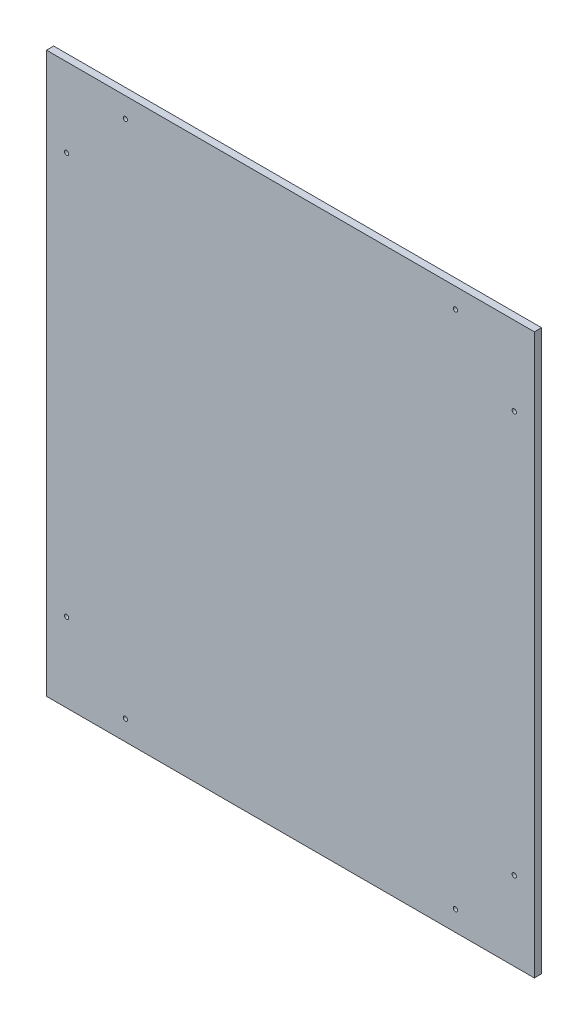
ISO-10303-21;
HEADER;
FILE_DESCRIPTION(('STEP AP214'),'2;1');
FILE_NAME('part.step','',(''),(''),'','','');
FILE_SCHEMA(('AUTOMOTIVE_DESIGN { 1 0 10303 214 1 1 1 1 }'));
ENDSEC;
DATA;
#1=APPLICATION_CONTEXT('core data for automotive mechanical design processes');
#2=APPLICATION_PROTOCOL_DEFINITION('international standard','automotive_design',2000,#1);
#3=PRODUCT_CONTEXT('',#1,'mechanical');
#4=PRODUCT('Part','Part','',(#3));
#5=PRODUCT_RELATED_PRODUCT_CATEGORY('part','',(#4));
#6=PRODUCT_DEFINITION_FORMATION('','',#4);
#7=PRODUCT_DEFINITION_CONTEXT('part definition',#1,'design');
#8=PRODUCT_DEFINITION('design','',#6,#7);
#9=PRODUCT_DEFINITION_SHAPE('','',#8);
#10=(LENGTH_UNIT() NAMED_UNIT(*) SI_UNIT(.MILLI.,.METRE.));
#11=(NAMED_UNIT(*) PLANE_ANGLE_UNIT() SI_UNIT($,.RADIAN.));
#12=(NAMED_UNIT(*) SI_UNIT($,.STERADIAN.) SOLID_ANGLE_UNIT());
#13=UNCERTAINTY_MEASURE_WITH_UNIT(LENGTH_MEASURE(1.E-05),#10,'distance_accuracy_value','');
#14=(GEOMETRIC_REPRESENTATION_CONTEXT(3) GLOBAL_UNCERTAINTY_ASSIGNED_CONTEXT((#13)) GLOBAL_UNIT_ASSIGNED_CONTEXT((#10,
#11,#12)) REPRESENTATION_CONTEXT('',''));
#15=CARTESIAN_POINT('',(0.,0.,0.));
#16=DIRECTION('',(0.,0.,1.));
#17=DIRECTION('',(1.,0.,0.));
#18=AXIS2_PLACEMENT_3D('',#15,#16,#17);
#19=CARTESIAN_POINT('',(0.,0.,5.));
#20=DIRECTION('',(0.,0.,1.));
#21=DIRECTION('',(1.,0.,0.));
#22=AXIS2_PLACEMENT_3D('',#19,#20,#21);
#23=PLANE('',#22);
#24=CARTESIAN_POINT('',(223.94719541036,35.5360255420485,5.));
#25=DIRECTION('',(0.,0.,1.));
#26=DIRECTION('',(1.,0.,0.));
#27=AXIS2_PLACEMENT_3D('',#24,#25,#26);
#28=CIRCLE('',#27,1.5);
#29=CARTESIAN_POINT('',(225.44719541036,35.5360255420485,5.));
#30=VERTEX_POINT('',#29);
#31=EDGE_CURVE('E145',#30,#30,#28,.T.);
#32=ORIENTED_EDGE('',*,*,#31,.F.);
#33=EDGE_LOOP('',(#32));
#34=FACE_BOUND('',#33,.T.);
#35=CARTESIAN_POINT('',(-6.05280458963955,-326.463974457952,5.));
#36=DIRECTION('',(0.,0.,1.));
#37=DIRECTION('',(1.,0.,0.));
#38=AXIS2_PLACEMENT_3D('',#35,#36,#37);
#39=CIRCLE('',#38,1.5);
#40=CARTESIAN_POINT('',(-4.55280458963955,-326.463974457952,5.));
#41=VERTEX_POINT('',#40);
#42=EDGE_CURVE('E133',#41,#41,#39,.T.);
#43=ORIENTED_EDGE('',*,*,#42,.F.);
#44=EDGE_LOOP('',(#43));
#45=FACE_BOUND('',#44,.T.);
#46=CARTESIAN_POINT('',(264.94719541036,-5.4639744579515,5.));
#47=DIRECTION('',(0.,0.,1.));
#48=DIRECTION('',(1.,0.,0.));
#49=AXIS2_PLACEMENT_3D('',#46,#47,#48);
#50=CIRCLE('',#49,1.50000000000002);
#51=CARTESIAN_POINT('',(266.44719541036,-5.4639744579515,5.));
#52=VERTEX_POINT('',#51);
#53=EDGE_CURVE('E121',#52,#52,#50,.T.);
#54=ORIENTED_EDGE('',*,*,#53,.F.);
#55=EDGE_LOOP('',(#54));
#56=FACE_BOUND('',#55,.T.);
#57=CARTESIAN_POINT('',(-47.0528045896396,-285.463974457952,5.));
#58=DIRECTION('',(0.,0.,1.));
#59=DIRECTION('',(1.,0.,0.));
#60=AXIS2_PLACEMENT_3D('',#57,#58,#59);
#61=CIRCLE('',#60,1.5);
#62=CARTESIAN_POINT('',(-45.5528045896396,-285.463974457952,5.));
#63=VERTEX_POINT('',#62);
#64=EDGE_CURVE('E100',#63,#63,#61,.T.);
#65=ORIENTED_EDGE('',*,*,#64,.F.);
#66=EDGE_LOOP('',(#65));
#67=FACE_BOUND('',#66,.T.);
#68=DIRECTION('',(0.,-1.,0.));
#69=VECTOR('',#68,1.);
#70=CARTESIAN_POINT('',(-61.0528045896396,49.5360255420485,5.));
#71=LINE('',#70,#69);
#72=CARTESIAN_POINT('',(-61.0528045896396,49.5360255420485,5.));
#73=VERTEX_POINT('',#72);
#74=CARTESIAN_POINT('',(-61.0528045896396,-340.463974457952,5.));
#75=VERTEX_POINT('',#74);
#76=EDGE_CURVE('E85',#73,#75,#71,.T.);
#77=ORIENTED_EDGE('',*,*,#76,.T.);
#78=DIRECTION('',(1.,0.,0.));
#79=VECTOR('',#78,1.);
#80=CARTESIAN_POINT('',(-61.0528045896396,-340.463974457952,5.));
#81=LINE('',#80,#79);
#82=CARTESIAN_POINT('',(278.94719541036,-340.463974457952,5.));
#83=VERTEX_POINT('',#82);
#84=EDGE_CURVE('E80',#75,#83,#81,.T.);
#85=ORIENTED_EDGE('',*,*,#84,.T.);
#86=DIRECTION('',(0.,1.,0.));
#87=VECTOR('',#86,1.);
#88=CARTESIAN_POINT('',(278.94719541036,49.5360255420485,5.));
#89=LINE('',#88,#87);
#90=CARTESIAN_POINT('',(278.94719541036,49.5360255420485,5.));
#91=VERTEX_POINT('',#90);
#92=EDGE_CURVE('E83',#83,#91,#89,.T.);
#93=ORIENTED_EDGE('',*,*,#92,.T.);
#94=DIRECTION('',(-1.,0.,0.));
#95=VECTOR('',#94,1.);
#96=CARTESIAN_POINT('',(-61.0528045896396,49.5360255420485,5.));
#97=LINE('',#96,#95);
#98=EDGE_CURVE('E50',#91,#73,#97,.T.);
#99=ORIENTED_EDGE('',*,*,#98,.T.);
#100=EDGE_LOOP('',(#77,#85,#93,#99));
#101=FACE_BOUND('',#100,.T.);
#102=CARTESIAN_POINT('',(264.94719541036,-285.463974457952,5.));
#103=DIRECTION('',(0.,0.,1.));
#104=DIRECTION('',(1.,0.,0.));
#105=AXIS2_PLACEMENT_3D('',#102,#103,#104);
#106=CIRCLE('',#105,1.50000000000002);
#107=CARTESIAN_POINT('',(266.44719541036,-285.463974457952,5.));
#108=VERTEX_POINT('',#107);
#109=EDGE_CURVE('E115',#108,#108,#106,.T.);
#110=ORIENTED_EDGE('',*,*,#109,.F.);
#111=EDGE_LOOP('',(#110));
#112=FACE_BOUND('',#111,.T.);
#113=CARTESIAN_POINT('',(-47.0528045896396,-5.4639744579515,5.));
#114=DIRECTION('',(0.,0.,1.));
#115=DIRECTION('',(1.,0.,0.));
#116=AXIS2_PLACEMENT_3D('',#113,#114,#115);
#117=CIRCLE('',#116,1.5);
#118=CARTESIAN_POINT('',(-45.5528045896396,-5.4639744579515,5.));
#119=VERTEX_POINT('',#118);
#120=EDGE_CURVE('E127',#119,#119,#117,.T.);
#121=ORIENTED_EDGE('',*,*,#120,.F.);
#122=EDGE_LOOP('',(#121));
#123=FACE_BOUND('',#122,.T.);
#124=CARTESIAN_POINT('',(223.94719541036,-326.463974457952,5.));
#125=DIRECTION('',(0.,0.,1.));
#126=DIRECTION('',(1.,0.,0.));
#127=AXIS2_PLACEMENT_3D('',#124,#125,#126);
#128=CIRCLE('',#127,1.5);
#129=CARTESIAN_POINT('',(225.44719541036,-326.463974457952,5.));
#130=VERTEX_POINT('',#129);
#131=EDGE_CURVE('E139',#130,#130,#128,.T.);
#132=ORIENTED_EDGE('',*,*,#131,.F.);
#133=EDGE_LOOP('',(#132));
#134=FACE_BOUND('',#133,.T.);
#135=CARTESIAN_POINT('',(-6.0528045896396,35.5360255420485,5.));
#136=DIRECTION('',(0.,0.,1.));
#137=DIRECTION('',(1.,0.,0.));
#138=AXIS2_PLACEMENT_3D('',#135,#136,#137);
#139=CIRCLE('',#138,1.5);
#140=CARTESIAN_POINT('',(-4.5528045896396,35.5360255420485,5.));
#141=VERTEX_POINT('',#140);
#142=EDGE_CURVE('E151',#141,#141,#139,.T.);
#143=ORIENTED_EDGE('',*,*,#142,.F.);
#144=EDGE_LOOP('',(#143));
#145=FACE_BOUND('',#144,.T.);
#146=ADVANCED_FACE('F33',(#34,#45,#56,#67,#101,#112,#123,#134,#145),#23,.T.);
#147=CARTESIAN_POINT('',(0.,0.,0.));
#148=DIRECTION('',(0.,0.,1.));
#149=DIRECTION('',(1.,0.,0.));
#150=AXIS2_PLACEMENT_3D('',#147,#148,#149);
#151=PLANE('',#150);
#152=DIRECTION('',(0.,-1.,0.));
#153=VECTOR('',#152,1.);
#154=CARTESIAN_POINT('',(-61.0528045896396,49.5360255420485,0.));
#155=LINE('',#154,#153);
#156=CARTESIAN_POINT('',(-61.0528045896396,49.5360255420485,0.));
#157=VERTEX_POINT('',#156);
#158=CARTESIAN_POINT('',(-61.0528045896396,-340.463974457952,0.));
#159=VERTEX_POINT('',#158);
#160=EDGE_CURVE('E97',#157,#159,#155,.T.);
#161=ORIENTED_EDGE('',*,*,#160,.F.);
#162=DIRECTION('',(-1.,0.,0.));
#163=VECTOR('',#162,1.);
#164=CARTESIAN_POINT('',(-61.0528045896396,49.5360255420485,0.));
#165=LINE('',#164,#163);
#166=CARTESIAN_POINT('',(278.94719541036,49.5360255420485,0.));
#167=VERTEX_POINT('',#166);
#168=EDGE_CURVE('E73',#167,#157,#165,.T.);
#169=ORIENTED_EDGE('',*,*,#168,.F.);
#170=DIRECTION('',(0.,1.,0.));
#171=VECTOR('',#170,1.);
#172=CARTESIAN_POINT('',(278.94719541036,49.5360255420485,0.));
#173=LINE('',#172,#171);
#174=CARTESIAN_POINT('',(278.94719541036,-340.463974457952,0.));
#175=VERTEX_POINT('',#174);
#176=EDGE_CURVE('E67',#175,#167,#173,.T.);
#177=ORIENTED_EDGE('',*,*,#176,.F.);
#178=DIRECTION('',(1.,0.,0.));
#179=VECTOR('',#178,1.);
#180=CARTESIAN_POINT('',(-61.0528045896396,-340.463974457952,0.));
#181=LINE('',#180,#179);
#182=EDGE_CURVE('E89',#159,#175,#181,.T.);
#183=ORIENTED_EDGE('',*,*,#182,.F.);
#184=EDGE_LOOP('',(#161,#169,#177,#183));
#185=FACE_BOUND('',#184,.T.);
#186=CARTESIAN_POINT('',(-47.0528045896396,-285.463974457952,0.));
#187=DIRECTION('',(0.,0.,1.));
#188=DIRECTION('',(1.,0.,0.));
#189=AXIS2_PLACEMENT_3D('',#186,#187,#188);
#190=CIRCLE('',#189,1.5);
#191=CARTESIAN_POINT('',(-45.5528045896396,-285.463974457952,0.));
#192=VERTEX_POINT('',#191);
#193=EDGE_CURVE('E112',#192,#192,#190,.T.);
#194=ORIENTED_EDGE('',*,*,#193,.T.);
#195=EDGE_LOOP('',(#194));
#196=FACE_BOUND('',#195,.T.);
#197=CARTESIAN_POINT('',(264.94719541036,-285.463974457952,0.));
#198=DIRECTION('',(0.,0.,1.));
#199=DIRECTION('',(1.,0.,0.));
#200=AXIS2_PLACEMENT_3D('',#197,#198,#199);
#201=CIRCLE('',#200,1.50000000000002);
#202=CARTESIAN_POINT('',(266.44719541036,-285.463974457952,0.));
#203=VERTEX_POINT('',#202);
#204=EDGE_CURVE('E118',#203,#203,#201,.T.);
#205=ORIENTED_EDGE('',*,*,#204,.T.);
#206=EDGE_LOOP('',(#205));
#207=FACE_BOUND('',#206,.T.);
#208=CARTESIAN_POINT('',(264.94719541036,-5.4639744579515,0.));
#209=DIRECTION('',(0.,0.,1.));
#210=DIRECTION('',(1.,0.,0.));
#211=AXIS2_PLACEMENT_3D('',#208,#209,#210);
#212=CIRCLE('',#211,1.50000000000002);
#213=CARTESIAN_POINT('',(266.44719541036,-5.4639744579515,0.));
#214=VERTEX_POINT('',#213);
#215=EDGE_CURVE('E124',#214,#214,#212,.T.);
#216=ORIENTED_EDGE('',*,*,#215,.T.);
#217=EDGE_LOOP('',(#216));
#218=FACE_BOUND('',#217,.T.);
#219=CARTESIAN_POINT('',(-47.0528045896396,-5.4639744579515,0.));
#220=DIRECTION('',(0.,0.,1.));
#221=DIRECTION('',(1.,0.,0.));
#222=AXIS2_PLACEMENT_3D('',#219,#220,#221);
#223=CIRCLE('',#222,1.5);
#224=CARTESIAN_POINT('',(-45.5528045896396,-5.4639744579515,0.));
#225=VERTEX_POINT('',#224);
#226=EDGE_CURVE('E130',#225,#225,#223,.T.);
#227=ORIENTED_EDGE('',*,*,#226,.T.);
#228=EDGE_LOOP('',(#227));
#229=FACE_BOUND('',#228,.T.);
#230=CARTESIAN_POINT('',(-6.05280458963955,-326.463974457952,0.));
#231=DIRECTION('',(0.,0.,1.));
#232=DIRECTION('',(1.,0.,0.));
#233=AXIS2_PLACEMENT_3D('',#230,#231,#232);
#234=CIRCLE('',#233,1.5);
#235=CARTESIAN_POINT('',(-4.55280458963955,-326.463974457952,0.));
#236=VERTEX_POINT('',#235);
#237=EDGE_CURVE('E136',#236,#236,#234,.T.);
#238=ORIENTED_EDGE('',*,*,#237,.T.);
#239=EDGE_LOOP('',(#238));
#240=FACE_BOUND('',#239,.T.);
#241=CARTESIAN_POINT('',(223.94719541036,-326.463974457952,0.));
#242=DIRECTION('',(0.,0.,1.));
#243=DIRECTION('',(1.,0.,0.));
#244=AXIS2_PLACEMENT_3D('',#241,#242,#243);
#245=CIRCLE('',#244,1.5);
#246=CARTESIAN_POINT('',(225.44719541036,-326.463974457952,0.));
#247=VERTEX_POINT('',#246);
#248=EDGE_CURVE('E142',#247,#247,#245,.T.);
#249=ORIENTED_EDGE('',*,*,#248,.T.);
#250=EDGE_LOOP('',(#249));
#251=FACE_BOUND('',#250,.T.);
#252=CARTESIAN_POINT('',(223.94719541036,35.5360255420485,0.));
#253=DIRECTION('',(0.,0.,1.));
#254=DIRECTION('',(1.,0.,0.));
#255=AXIS2_PLACEMENT_3D('',#252,#253,#254);
#256=CIRCLE('',#255,1.5);
#257=CARTESIAN_POINT('',(225.44719541036,35.5360255420485,0.));
#258=VERTEX_POINT('',#257);
#259=EDGE_CURVE('E148',#258,#258,#256,.T.);
#260=ORIENTED_EDGE('',*,*,#259,.T.);
#261=EDGE_LOOP('',(#260));
#262=FACE_BOUND('',#261,.T.);
#263=CARTESIAN_POINT('',(-6.0528045896396,35.5360255420485,0.));
#264=DIRECTION('',(0.,0.,1.));
#265=DIRECTION('',(1.,0.,0.));
#266=AXIS2_PLACEMENT_3D('',#263,#264,#265);
#267=CIRCLE('',#266,1.5);
#268=CARTESIAN_POINT('',(-4.5528045896396,35.5360255420485,0.));
#269=VERTEX_POINT('',#268);
#270=EDGE_CURVE('E154',#269,#269,#267,.T.);
#271=ORIENTED_EDGE('',*,*,#270,.T.);
#272=EDGE_LOOP('',(#271));
#273=FACE_BOUND('',#272,.T.);
#274=ADVANCED_FACE('F108',(#185,#196,#207,#218,#229,#240,#251,#262,#273),#151,.F.);
#275=CARTESIAN_POINT('',(-61.0528045896396,49.5360255420485,5.));
#276=DIRECTION('',(1.,0.,0.));
#277=DIRECTION('',(0.,1.,0.));
#278=AXIS2_PLACEMENT_3D('',#275,#276,#277);
#279=PLANE('',#278);
#280=ORIENTED_EDGE('',*,*,#160,.T.);
#281=DIRECTION('',(0.,0.,-1.));
#282=VECTOR('',#281,1.);
#283=CARTESIAN_POINT('',(-61.0528045896396,-340.463974457952,5.));
#284=LINE('',#283,#282);
#285=EDGE_CURVE('E11',#75,#159,#284,.T.);
#286=ORIENTED_EDGE('',*,*,#285,.F.);
#287=ORIENTED_EDGE('',*,*,#76,.F.);
#288=DIRECTION('',(0.,0.,-1.));
#289=VECTOR('',#288,1.);
#290=CARTESIAN_POINT('',(-61.0528045896396,49.5360255420485,5.));
#291=LINE('',#290,#289);
#292=EDGE_CURVE('E93',#73,#157,#291,.T.);
#293=ORIENTED_EDGE('',*,*,#292,.T.);
#294=EDGE_LOOP('',(#280,#286,#287,#293));
#295=FACE_BOUND('',#294,.T.);
#296=ADVANCED_FACE('F35',(#295),#279,.F.);
#297=CARTESIAN_POINT('',(-61.0528045896396,-340.463974457952,5.));
#298=DIRECTION('',(0.,1.,0.));
#299=DIRECTION('',(0.,0.,1.));
#300=AXIS2_PLACEMENT_3D('',#297,#298,#299);
#301=PLANE('',#300);
#302=ORIENTED_EDGE('',*,*,#182,.T.);
#303=DIRECTION('',(0.,0.,-1.));
#304=VECTOR('',#303,1.);
#305=CARTESIAN_POINT('',(278.94719541036,-340.463974457952,5.));
#306=LINE('',#305,#304);
#307=EDGE_CURVE('E42',#83,#175,#306,.T.);
#308=ORIENTED_EDGE('',*,*,#307,.F.);
#309=ORIENTED_EDGE('',*,*,#84,.F.);
#310=ORIENTED_EDGE('',*,*,#285,.T.);
#311=EDGE_LOOP('',(#302,#308,#309,#310));
#312=FACE_BOUND('',#311,.T.);
#313=ADVANCED_FACE('F88',(#312),#301,.F.);
#314=CARTESIAN_POINT('',(278.94719541036,49.5360255420485,5.));
#315=DIRECTION('',(-1.,0.,0.));
#316=DIRECTION('',(0.,-1.,0.));
#317=AXIS2_PLACEMENT_3D('',#314,#315,#316);
#318=PLANE('',#317);
#319=ORIENTED_EDGE('',*,*,#176,.T.);
#320=DIRECTION('',(0.,0.,-1.));
#321=VECTOR('',#320,1.);
#322=CARTESIAN_POINT('',(278.94719541036,49.5360255420485,5.));
#323=LINE('',#322,#321);
#324=EDGE_CURVE('E90',#91,#167,#323,.T.);
#325=ORIENTED_EDGE('',*,*,#324,.F.);
#326=ORIENTED_EDGE('',*,*,#92,.F.);
#327=ORIENTED_EDGE('',*,*,#307,.T.);
#328=EDGE_LOOP('',(#319,#325,#326,#327));
#329=FACE_BOUND('',#328,.T.);
#330=ADVANCED_FACE('F91',(#329),#318,.F.);
#331=CARTESIAN_POINT('',(-61.0528045896396,49.5360255420485,5.));
#332=DIRECTION('',(0.,-1.,0.));
#333=DIRECTION('',(0.,0.,-1.));
#334=AXIS2_PLACEMENT_3D('',#331,#332,#333);
#335=PLANE('',#334);
#336=ORIENTED_EDGE('',*,*,#168,.T.);
#337=ORIENTED_EDGE('',*,*,#292,.F.);
#338=ORIENTED_EDGE('',*,*,#98,.F.);
#339=ORIENTED_EDGE('',*,*,#324,.T.);
#340=EDGE_LOOP('',(#336,#337,#338,#339));
#341=FACE_BOUND('',#340,.T.);
#342=ADVANCED_FACE('F105',(#341),#335,.F.);
#343=CARTESIAN_POINT('',(-47.0528045896396,-285.463974457952,5.));
#344=DIRECTION('',(0.,0.,-1.));
#345=DIRECTION('',(-1.,0.,0.));
#346=AXIS2_PLACEMENT_3D('',#343,#344,#345);
#347=CYLINDRICAL_SURFACE('',#346,1.5);
#348=ORIENTED_EDGE('',*,*,#64,.T.);
#349=EDGE_LOOP('',(#348));
#350=FACE_BOUND('',#349,.T.);
#351=ORIENTED_EDGE('',*,*,#193,.F.);
#352=EDGE_LOOP('',(#351));
#353=FACE_BOUND('',#352,.T.);
#354=ADVANCED_FACE('F173',(#350,#353),#347,.F.);
#355=CARTESIAN_POINT('',(264.94719541036,-285.463974457952,5.));
#356=DIRECTION('',(0.,0.,-1.));
#357=DIRECTION('',(-1.,0.,0.));
#358=AXIS2_PLACEMENT_3D('',#355,#356,#357);
#359=CYLINDRICAL_SURFACE('',#358,1.50000000000002);
#360=ORIENTED_EDGE('',*,*,#109,.T.);
#361=EDGE_LOOP('',(#360));
#362=FACE_BOUND('',#361,.T.);
#363=ORIENTED_EDGE('',*,*,#204,.F.);
#364=EDGE_LOOP('',(#363));
#365=FACE_BOUND('',#364,.T.);
#366=ADVANCED_FACE('F219',(#362,#365),#359,.F.);
#367=CARTESIAN_POINT('',(264.94719541036,-5.4639744579515,5.));
#368=DIRECTION('',(0.,0.,-1.));
#369=DIRECTION('',(-1.,0.,0.));
#370=AXIS2_PLACEMENT_3D('',#367,#368,#369);
#371=CYLINDRICAL_SURFACE('',#370,1.50000000000002);
#372=ORIENTED_EDGE('',*,*,#53,.T.);
#373=EDGE_LOOP('',(#372));
#374=FACE_BOUND('',#373,.T.);
#375=ORIENTED_EDGE('',*,*,#215,.F.);
#376=EDGE_LOOP('',(#375));
#377=FACE_BOUND('',#376,.T.);
#378=ADVANCED_FACE('F227',(#374,#377),#371,.F.);
#379=CARTESIAN_POINT('',(-47.0528045896396,-5.4639744579515,5.));
#380=DIRECTION('',(0.,0.,-1.));
#381=DIRECTION('',(-1.,0.,0.));
#382=AXIS2_PLACEMENT_3D('',#379,#380,#381);
#383=CYLINDRICAL_SURFACE('',#382,1.5);
#384=ORIENTED_EDGE('',*,*,#120,.T.);
#385=EDGE_LOOP('',(#384));
#386=FACE_BOUND('',#385,.T.);
#387=ORIENTED_EDGE('',*,*,#226,.F.);
#388=EDGE_LOOP('',(#387));
#389=FACE_BOUND('',#388,.T.);
#390=ADVANCED_FACE('F235',(#386,#389),#383,.F.);
#391=CARTESIAN_POINT('',(-6.05280458963955,-326.463974457952,5.));
#392=DIRECTION('',(0.,0.,-1.));
#393=DIRECTION('',(-1.,0.,0.));
#394=AXIS2_PLACEMENT_3D('',#391,#392,#393);
#395=CYLINDRICAL_SURFACE('',#394,1.5);
#396=ORIENTED_EDGE('',*,*,#42,.T.);
#397=EDGE_LOOP('',(#396));
#398=FACE_BOUND('',#397,.T.);
#399=ORIENTED_EDGE('',*,*,#237,.F.);
#400=EDGE_LOOP('',(#399));
#401=FACE_BOUND('',#400,.T.);
#402=ADVANCED_FACE('F244',(#398,#401),#395,.F.);
#403=CARTESIAN_POINT('',(223.94719541036,-326.463974457952,5.));
#404=DIRECTION('',(0.,0.,-1.));
#405=DIRECTION('',(-1.,0.,0.));
#406=AXIS2_PLACEMENT_3D('',#403,#404,#405);
#407=CYLINDRICAL_SURFACE('',#406,1.5);
#408=ORIENTED_EDGE('',*,*,#131,.T.);
#409=EDGE_LOOP('',(#408));
#410=FACE_BOUND('',#409,.T.);
#411=ORIENTED_EDGE('',*,*,#248,.F.);
#412=EDGE_LOOP('',(#411));
#413=FACE_BOUND('',#412,.T.);
#414=ADVANCED_FACE('F253',(#410,#413),#407,.F.);
#415=CARTESIAN_POINT('',(223.94719541036,35.5360255420485,5.));
#416=DIRECTION('',(0.,0.,-1.));
#417=DIRECTION('',(-1.,0.,0.));
#418=AXIS2_PLACEMENT_3D('',#415,#416,#417);
#419=CYLINDRICAL_SURFACE('',#418,1.5);
#420=ORIENTED_EDGE('',*,*,#31,.T.);
#421=EDGE_LOOP('',(#420));
#422=FACE_BOUND('',#421,.T.);
#423=ORIENTED_EDGE('',*,*,#259,.F.);
#424=EDGE_LOOP('',(#423));
#425=FACE_BOUND('',#424,.T.);
#426=ADVANCED_FACE('F262',(#422,#425),#419,.F.);
#427=CARTESIAN_POINT('',(-6.0528045896396,35.5360255420485,5.));
#428=DIRECTION('',(0.,0.,-1.));
#429=DIRECTION('',(-1.,0.,0.));
#430=AXIS2_PLACEMENT_3D('',#427,#428,#429);
#431=CYLINDRICAL_SURFACE('',#430,1.5);
#432=ORIENTED_EDGE('',*,*,#142,.T.);
#433=EDGE_LOOP('',(#432));
#434=FACE_BOUND('',#433,.T.);
#435=ORIENTED_EDGE('',*,*,#270,.F.);
#436=EDGE_LOOP('',(#435));
#437=FACE_BOUND('',#436,.T.);
#438=ADVANCED_FACE('F160',(#434,#437),#431,.F.);
#439=CLOSED_SHELL('',(#146,#274,#296,#313,#330,#342,#354,#366,#378,#390,#402,#414,#426,#438));
#440=MANIFOLD_SOLID_BREP('B2',#439);
#441=ADVANCED_BREP_SHAPE_REPRESENTATION('',(#18,#440),#14);
#442=SHAPE_DEFINITION_REPRESENTATION(#9,#441);
ENDSEC;
END-ISO-10303-21;
